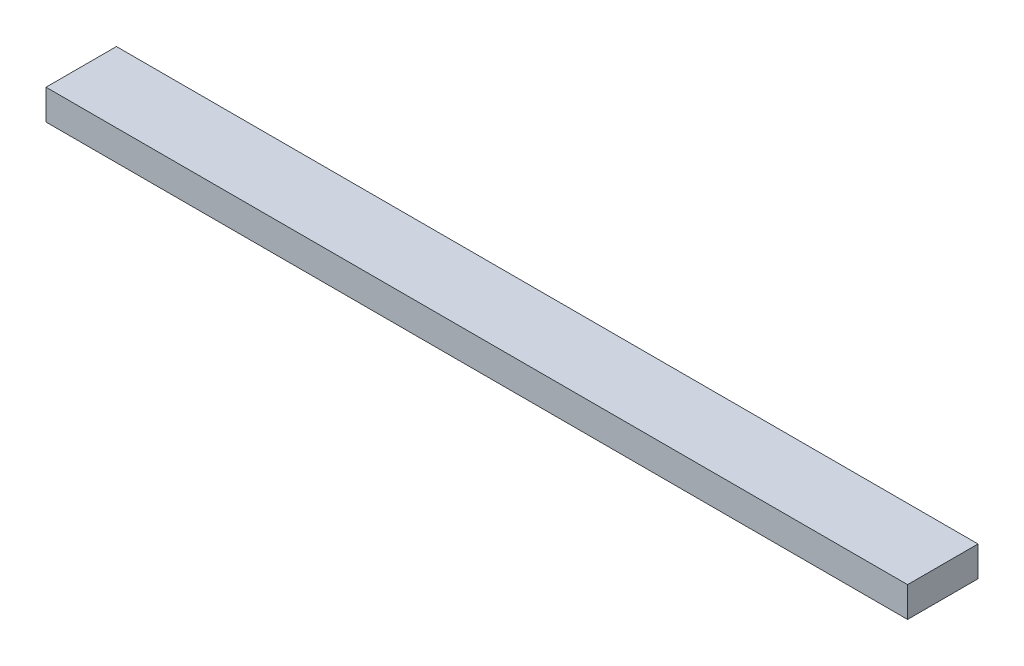
ISO-10303-21;
HEADER;
FILE_DESCRIPTION(('STEP AP214'),'2;1');
FILE_NAME('part.step','',(''),(''),'','','');
FILE_SCHEMA(('AUTOMOTIVE_DESIGN { 1 0 10303 214 1 1 1 1 }'));
ENDSEC;
DATA;
#1=APPLICATION_CONTEXT('core data for automotive mechanical design processes');
#2=APPLICATION_PROTOCOL_DEFINITION('international standard','automotive_design',2000,#1);
#3=PRODUCT_CONTEXT('',#1,'mechanical');
#4=PRODUCT('Part','Part','',(#3));
#5=PRODUCT_RELATED_PRODUCT_CATEGORY('part','',(#4));
#6=PRODUCT_DEFINITION_FORMATION('','',#4);
#7=PRODUCT_DEFINITION_CONTEXT('part definition',#1,'design');
#8=PRODUCT_DEFINITION('design','',#6,#7);
#9=PRODUCT_DEFINITION_SHAPE('','',#8);
#10=(LENGTH_UNIT() NAMED_UNIT(*) SI_UNIT(.MILLI.,.METRE.));
#11=(NAMED_UNIT(*) PLANE_ANGLE_UNIT() SI_UNIT($,.RADIAN.));
#12=(NAMED_UNIT(*) SI_UNIT($,.STERADIAN.) SOLID_ANGLE_UNIT());
#13=UNCERTAINTY_MEASURE_WITH_UNIT(LENGTH_MEASURE(1.E-05),#10,'distance_accuracy_value','');
#14=(GEOMETRIC_REPRESENTATION_CONTEXT(3) GLOBAL_UNCERTAINTY_ASSIGNED_CONTEXT((#13)) GLOBAL_UNIT_ASSIGNED_CONTEXT((#10,
#11,#12)) REPRESENTATION_CONTEXT('',''));
#15=CARTESIAN_POINT('',(0.,0.,0.));
#16=DIRECTION('',(0.,0.,1.));
#17=DIRECTION('',(1.,0.,0.));
#18=AXIS2_PLACEMENT_3D('',#15,#16,#17);
#19=CARTESIAN_POINT('',(0.,38.1,0.));
#20=DIRECTION('',(1.,0.,0.));
#21=DIRECTION('',(0.,0.,-1.));
#22=AXIS2_PLACEMENT_3D('',#19,#20,#21);
#23=PLANE('',#22);
#24=DIRECTION('',(0.,0.,1.));
#25=VECTOR('',#24,1.);
#26=CARTESIAN_POINT('',(0.,0.,0.));
#27=LINE('',#26,#25);
#28=CARTESIAN_POINT('',(0.,0.,-88.9));
#29=VERTEX_POINT('',#28);
#30=CARTESIAN_POINT('',(0.,0.,0.));
#31=VERTEX_POINT('',#30);
#32=EDGE_CURVE('E101',#29,#31,#27,.T.);
#33=ORIENTED_EDGE('',*,*,#32,.T.);
#34=DIRECTION('',(0.,-1.,0.));
#35=VECTOR('',#34,1.);
#36=CARTESIAN_POINT('',(0.,38.1,0.));
#37=LINE('',#36,#35);
#38=CARTESIAN_POINT('',(0.,38.1,0.));
#39=VERTEX_POINT('',#38);
#40=EDGE_CURVE('E11',#39,#31,#37,.T.);
#41=ORIENTED_EDGE('',*,*,#40,.F.);
#42=DIRECTION('',(0.,0.,1.));
#43=VECTOR('',#42,1.);
#44=CARTESIAN_POINT('',(0.,38.1,0.));
#45=LINE('',#44,#43);
#46=CARTESIAN_POINT('',(0.,38.1,-88.9));
#47=VERTEX_POINT('',#46);
#48=EDGE_CURVE('E89',#47,#39,#45,.T.);
#49=ORIENTED_EDGE('',*,*,#48,.F.);
#50=DIRECTION('',(0.,-1.,0.));
#51=VECTOR('',#50,1.);
#52=CARTESIAN_POINT('',(0.,38.1,-88.9));
#53=LINE('',#52,#51);
#54=EDGE_CURVE('E97',#47,#29,#53,.T.);
#55=ORIENTED_EDGE('',*,*,#54,.T.);
#56=EDGE_LOOP('',(#33,#41,#49,#55));
#57=FACE_BOUND('',#56,.T.);
#58=ADVANCED_FACE('F38',(#57),#23,.F.);
#59=CARTESIAN_POINT('',(0.,38.1,0.));
#60=DIRECTION('',(0.,0.,-1.));
#61=DIRECTION('',(-1.,0.,0.));
#62=AXIS2_PLACEMENT_3D('',#59,#60,#61);
#63=PLANE('',#62);
#64=DIRECTION('',(1.,0.,0.));
#65=VECTOR('',#64,1.);
#66=CARTESIAN_POINT('',(0.,0.,0.));
#67=LINE('',#66,#65);
#68=CARTESIAN_POINT('',(1087.4502,0.,0.));
#69=VERTEX_POINT('',#68);
#70=EDGE_CURVE('E93',#31,#69,#67,.T.);
#71=ORIENTED_EDGE('',*,*,#70,.T.);
#72=DIRECTION('',(0.,-1.,0.));
#73=VECTOR('',#72,1.);
#74=CARTESIAN_POINT('',(1087.4502,38.1,0.));
#75=LINE('',#74,#73);
#76=CARTESIAN_POINT('',(1087.4502,38.1,0.));
#77=VERTEX_POINT('',#76);
#78=EDGE_CURVE('E46',#77,#69,#75,.T.);
#79=ORIENTED_EDGE('',*,*,#78,.F.);
#80=DIRECTION('',(1.,0.,0.));
#81=VECTOR('',#80,1.);
#82=CARTESIAN_POINT('',(0.,38.1,0.));
#83=LINE('',#82,#81);
#84=EDGE_CURVE('E84',#39,#77,#83,.T.);
#85=ORIENTED_EDGE('',*,*,#84,.F.);
#86=ORIENTED_EDGE('',*,*,#40,.T.);
#87=EDGE_LOOP('',(#71,#79,#85,#86));
#88=FACE_BOUND('',#87,.T.);
#89=ADVANCED_FACE('F92',(#88),#63,.F.);
#90=CARTESIAN_POINT('',(1087.4502,38.1,0.));
#91=DIRECTION('',(-1.,0.,0.));
#92=DIRECTION('',(0.,0.,1.));
#93=AXIS2_PLACEMENT_3D('',#90,#91,#92);
#94=PLANE('',#93);
#95=DIRECTION('',(0.,0.,-1.));
#96=VECTOR('',#95,1.);
#97=CARTESIAN_POINT('',(1087.4502,0.,0.));
#98=LINE('',#97,#96);
#99=CARTESIAN_POINT('',(1087.4502,0.,-88.9));
#100=VERTEX_POINT('',#99);
#101=EDGE_CURVE('E71',#69,#100,#98,.T.);
#102=ORIENTED_EDGE('',*,*,#101,.T.);
#103=DIRECTION('',(0.,-1.,0.));
#104=VECTOR('',#103,1.);
#105=CARTESIAN_POINT('',(1087.4502,38.1,-88.9));
#106=LINE('',#105,#104);
#107=CARTESIAN_POINT('',(1087.4502,38.1,-88.9));
#108=VERTEX_POINT('',#107);
#109=EDGE_CURVE('E94',#108,#100,#106,.T.);
#110=ORIENTED_EDGE('',*,*,#109,.F.);
#111=DIRECTION('',(0.,0.,-1.));
#112=VECTOR('',#111,1.);
#113=CARTESIAN_POINT('',(1087.4502,38.1,0.));
#114=LINE('',#113,#112);
#115=EDGE_CURVE('E87',#77,#108,#114,.T.);
#116=ORIENTED_EDGE('',*,*,#115,.F.);
#117=ORIENTED_EDGE('',*,*,#78,.T.);
#118=EDGE_LOOP('',(#102,#110,#116,#117));
#119=FACE_BOUND('',#118,.T.);
#120=ADVANCED_FACE('F95',(#119),#94,.F.);
#121=CARTESIAN_POINT('',(0.,38.1,-88.9));
#122=DIRECTION('',(0.,0.,1.));
#123=DIRECTION('',(1.,0.,0.));
#124=AXIS2_PLACEMENT_3D('',#121,#122,#123);
#125=PLANE('',#124);
#126=DIRECTION('',(-1.,0.,0.));
#127=VECTOR('',#126,1.);
#128=CARTESIAN_POINT('',(0.,0.,-88.9));
#129=LINE('',#128,#127);
#130=EDGE_CURVE('E77',#100,#29,#129,.T.);
#131=ORIENTED_EDGE('',*,*,#130,.T.);
#132=ORIENTED_EDGE('',*,*,#54,.F.);
#133=DIRECTION('',(-1.,0.,0.));
#134=VECTOR('',#133,1.);
#135=CARTESIAN_POINT('',(0.,38.1,-88.9));
#136=LINE('',#135,#134);
#137=EDGE_CURVE('E54',#108,#47,#136,.T.);
#138=ORIENTED_EDGE('',*,*,#137,.F.);
#139=ORIENTED_EDGE('',*,*,#109,.T.);
#140=EDGE_LOOP('',(#131,#132,#138,#139));
#141=FACE_BOUND('',#140,.T.);
#142=ADVANCED_FACE('F108',(#141),#125,.F.);
#143=CARTESIAN_POINT('',(0.,38.1,0.));
#144=DIRECTION('',(0.,-1.,0.));
#145=DIRECTION('',(0.,0.,-1.));
#146=AXIS2_PLACEMENT_3D('',#143,#144,#145);
#147=PLANE('',#146);
#148=ORIENTED_EDGE('',*,*,#48,.T.);
#149=ORIENTED_EDGE('',*,*,#84,.T.);
#150=ORIENTED_EDGE('',*,*,#115,.T.);
#151=ORIENTED_EDGE('',*,*,#137,.T.);
#152=EDGE_LOOP('',(#148,#149,#150,#151));
#153=FACE_BOUND('',#152,.T.);
#154=ADVANCED_FACE('F85',(#153),#147,.F.);
#155=CARTESIAN_POINT('',(0.,0.,0.));
#156=DIRECTION('',(0.,-1.,0.));
#157=DIRECTION('',(0.,0.,-1.));
#158=AXIS2_PLACEMENT_3D('',#155,#156,#157);
#159=PLANE('',#158);
#160=ORIENTED_EDGE('',*,*,#32,.F.);
#161=ORIENTED_EDGE('',*,*,#130,.F.);
#162=ORIENTED_EDGE('',*,*,#101,.F.);
#163=ORIENTED_EDGE('',*,*,#70,.F.);
#164=EDGE_LOOP('',(#160,#161,#162,#163));
#165=FACE_BOUND('',#164,.T.);
#166=ADVANCED_FACE('F111',(#165),#159,.T.);
#167=CLOSED_SHELL('',(#58,#89,#120,#142,#154,#166));
#168=MANIFOLD_SOLID_BREP('B2',#167);
#169=ADVANCED_BREP_SHAPE_REPRESENTATION('',(#18,#168),#14);
#170=SHAPE_DEFINITION_REPRESENTATION(#9,#169);
ENDSEC;
END-ISO-10303-21;
